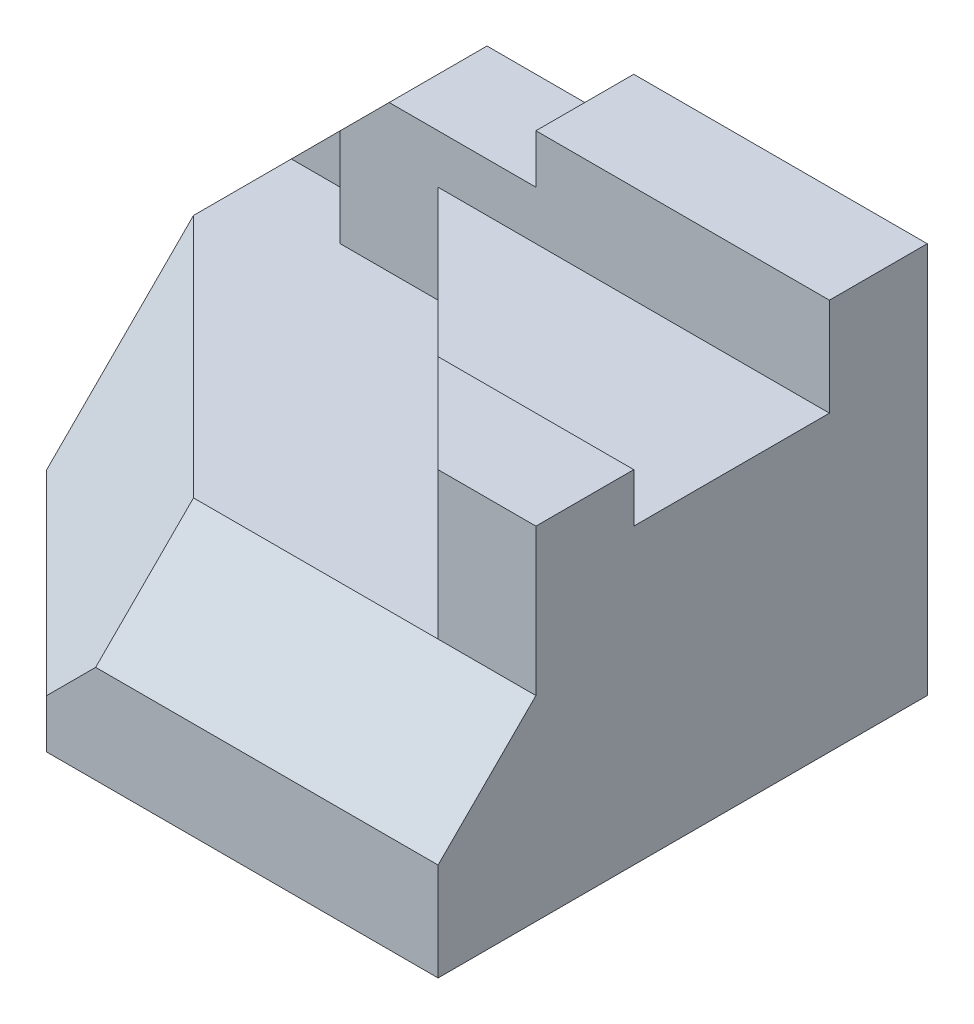
ISO-10303-21;
HEADER;
FILE_DESCRIPTION(('STEP AP214'),'2;1');
FILE_NAME('part.step','',(''),(''),'','','');
FILE_SCHEMA(('AUTOMOTIVE_DESIGN { 1 0 10303 214 1 1 1 1 }'));
ENDSEC;
DATA;
#1=APPLICATION_CONTEXT('core data for automotive mechanical design processes');
#2=APPLICATION_PROTOCOL_DEFINITION('international standard','automotive_design',2000,#1);
#3=PRODUCT_CONTEXT('',#1,'mechanical');
#4=PRODUCT('Part','Part','',(#3));
#5=PRODUCT_RELATED_PRODUCT_CATEGORY('part','',(#4));
#6=PRODUCT_DEFINITION_FORMATION('','',#4);
#7=PRODUCT_DEFINITION_CONTEXT('part definition',#1,'design');
#8=PRODUCT_DEFINITION('design','',#6,#7);
#9=PRODUCT_DEFINITION_SHAPE('','',#8);
#10=(LENGTH_UNIT() NAMED_UNIT(*) SI_UNIT(.MILLI.,.METRE.));
#11=(NAMED_UNIT(*) PLANE_ANGLE_UNIT() SI_UNIT($,.RADIAN.));
#12=(NAMED_UNIT(*) SI_UNIT($,.STERADIAN.) SOLID_ANGLE_UNIT());
#13=UNCERTAINTY_MEASURE_WITH_UNIT(LENGTH_MEASURE(1.E-05),#10,'distance_accuracy_value','');
#14=(GEOMETRIC_REPRESENTATION_CONTEXT(3) GLOBAL_UNCERTAINTY_ASSIGNED_CONTEXT((#13)) GLOBAL_UNIT_ASSIGNED_CONTEXT((#10,
#11,#12)) REPRESENTATION_CONTEXT('',''));
#15=CARTESIAN_POINT('',(0.,0.,0.));
#16=DIRECTION('',(0.,0.,1.));
#17=DIRECTION('',(1.,0.,0.));
#18=AXIS2_PLACEMENT_3D('',#15,#16,#17);
#19=CARTESIAN_POINT('',(-36.,60.,60.));
#20=DIRECTION('',(0.,-0.707106781186548,-0.707106781186548));
#21=DIRECTION('',(0.,0.707106781186548,-0.707106781186548));
#22=AXIS2_PLACEMENT_3D('',#19,#20,#21);
#23=PLANE('',#22);
#24=DIRECTION('',(1.,0.,0.));
#25=VECTOR('',#24,1.);
#26=CARTESIAN_POINT('',(-36.,40.,80.));
#27=LINE('',#26,#25);
#28=CARTESIAN_POINT('',(50.,40.,80.));
#29=VERTEX_POINT('',#28);
#30=CARTESIAN_POINT('',(100.,40.,80.));
#31=VERTEX_POINT('',#30);
#32=EDGE_CURVE('E91',#29,#31,#27,.T.);
#33=ORIENTED_EDGE('',*,*,#32,.F.);
#34=DIRECTION('',(0.,-0.707106781186547,0.707106781186547));
#35=VECTOR('',#34,1.);
#36=CARTESIAN_POINT('',(50.,60.,60.0000000000001));
#37=LINE('',#36,#35);
#38=CARTESIAN_POINT('',(50.,20.,100.));
#39=VERTEX_POINT('',#38);
#40=EDGE_CURVE('E51',#29,#39,#37,.T.);
#41=ORIENTED_EDGE('',*,*,#40,.T.);
#42=DIRECTION('',(1.,0.,0.));
#43=VECTOR('',#42,1.);
#44=CARTESIAN_POINT('',(-36.,20.,100.));
#45=LINE('',#44,#43);
#46=CARTESIAN_POINT('',(120.,20.,100.));
#47=VERTEX_POINT('',#46);
#48=EDGE_CURVE('E36',#39,#47,#45,.T.);
#49=ORIENTED_EDGE('',*,*,#48,.T.);
#50=DIRECTION('',(0.,0.707106781186548,-0.707106781186548));
#51=VECTOR('',#50,1.);
#52=CARTESIAN_POINT('',(120.,60.,60.));
#53=LINE('',#52,#51);
#54=CARTESIAN_POINT('',(120.,40.,80.));
#55=VERTEX_POINT('',#54);
#56=EDGE_CURVE('E186',#47,#55,#53,.T.);
#57=ORIENTED_EDGE('',*,*,#56,.T.);
#58=DIRECTION('',(1.,0.,0.));
#59=VECTOR('',#58,1.);
#60=CARTESIAN_POINT('',(120.,40.,80.));
#61=LINE('',#60,#59);
#62=EDGE_CURVE('E285',#31,#55,#61,.T.);
#63=ORIENTED_EDGE('',*,*,#62,.F.);
#64=EDGE_LOOP('',(#33,#41,#49,#57,#63));
#65=FACE_BOUND('',#64,.T.);
#66=ADVANCED_FACE('F33',(#65),#23,.F.);
#67=CARTESIAN_POINT('',(0.,60.,0.));
#68=DIRECTION('',(0.,-1.,0.));
#69=DIRECTION('',(0.,0.,-1.));
#70=AXIS2_PLACEMENT_3D('',#67,#68,#69);
#71=PLANE('',#70);
#72=DIRECTION('',(-1.,0.,0.));
#73=VECTOR('',#72,1.);
#74=CARTESIAN_POINT('',(80.,60.,60.));
#75=LINE('',#74,#73);
#76=CARTESIAN_POINT('',(120.,60.,60.));
#77=VERTEX_POINT('',#76);
#78=CARTESIAN_POINT('',(80.,60.,60.));
#79=VERTEX_POINT('',#78);
#80=EDGE_CURVE('E168',#77,#79,#75,.T.);
#81=ORIENTED_EDGE('',*,*,#80,.F.);
#82=DIRECTION('',(0.,0.,-1.));
#83=VECTOR('',#82,1.);
#84=CARTESIAN_POINT('',(120.,60.,20.));
#85=LINE('',#84,#83);
#86=CARTESIAN_POINT('',(120.,60.,20.));
#87=VERTEX_POINT('',#86);
#88=EDGE_CURVE('E171',#77,#87,#85,.T.);
#89=ORIENTED_EDGE('',*,*,#88,.T.);
#90=DIRECTION('',(-1.,0.,0.));
#91=VECTOR('',#90,1.);
#92=CARTESIAN_POINT('',(40.,60.,20.));
#93=LINE('',#92,#91);
#94=CARTESIAN_POINT('',(40.,60.,20.));
#95=VERTEX_POINT('',#94);
#96=EDGE_CURVE('E107',#87,#95,#93,.T.);
#97=ORIENTED_EDGE('',*,*,#96,.T.);
#98=DIRECTION('',(0.707106781186547,0.,0.707106781186547));
#99=VECTOR('',#98,1.);
#100=CARTESIAN_POINT('',(100.,60.,80.));
#101=LINE('',#100,#99);
#102=EDGE_CURVE('E102',#95,#79,#101,.T.);
#103=ORIENTED_EDGE('',*,*,#102,.T.);
#104=EDGE_LOOP('',(#81,#89,#97,#103));
#105=FACE_BOUND('',#104,.T.);
#106=ADVANCED_FACE('F170',(#105),#71,.F.);
#107=CARTESIAN_POINT('',(0.,40.,0.));
#108=DIRECTION('',(0.,1.,0.));
#109=DIRECTION('',(0.,0.,1.));
#110=AXIS2_PLACEMENT_3D('',#107,#108,#109);
#111=PLANE('',#110);
#112=DIRECTION('',(-0.707106781186548,0.,-0.707106781186547));
#113=VECTOR('',#112,1.);
#114=CARTESIAN_POINT('',(50.,40.,80.));
#115=LINE('',#114,#113);
#116=CARTESIAN_POINT('',(0.,40.,30.));
#117=VERTEX_POINT('',#116);
#118=EDGE_CURVE('E62',#29,#117,#115,.T.);
#119=ORIENTED_EDGE('',*,*,#118,.F.);
#120=ORIENTED_EDGE('',*,*,#32,.T.);
#121=DIRECTION('',(0.707106781186547,0.,0.707106781186547));
#122=VECTOR('',#121,1.);
#123=CARTESIAN_POINT('',(100.,40.,80.));
#124=LINE('',#123,#122);
#125=CARTESIAN_POINT('',(40.,40.,20.));
#126=VERTEX_POINT('',#125);
#127=EDGE_CURVE('E197',#126,#31,#124,.T.);
#128=ORIENTED_EDGE('',*,*,#127,.F.);
#129=DIRECTION('',(-1.,0.,0.));
#130=VECTOR('',#129,1.);
#131=CARTESIAN_POINT('',(0.,40.,20.));
#132=LINE('',#131,#130);
#133=CARTESIAN_POINT('',(20.,40.,20.));
#134=VERTEX_POINT('',#133);
#135=EDGE_CURVE('E205',#126,#134,#132,.T.);
#136=ORIENTED_EDGE('',*,*,#135,.T.);
#137=DIRECTION('',(0.,0.,1.));
#138=VECTOR('',#137,1.);
#139=CARTESIAN_POINT('',(20.,40.,10.));
#140=LINE('',#139,#138);
#141=CARTESIAN_POINT('',(20.,40.,10.));
#142=VERTEX_POINT('',#141);
#143=EDGE_CURVE('E266',#142,#134,#140,.T.);
#144=ORIENTED_EDGE('',*,*,#143,.F.);
#145=DIRECTION('',(1.,0.,0.));
#146=VECTOR('',#145,1.);
#147=CARTESIAN_POINT('',(0.,40.,10.));
#148=LINE('',#147,#146);
#149=CARTESIAN_POINT('',(0.,40.,10.));
#150=VERTEX_POINT('',#149);
#151=EDGE_CURVE('E269',#150,#142,#148,.T.);
#152=ORIENTED_EDGE('',*,*,#151,.F.);
#153=DIRECTION('',(0.,0.,-1.));
#154=VECTOR('',#153,1.);
#155=CARTESIAN_POINT('',(0.,40.,100.));
#156=LINE('',#155,#154);
#157=EDGE_CURVE('E235',#117,#150,#156,.T.);
#158=ORIENTED_EDGE('',*,*,#157,.F.);
#159=EDGE_LOOP('',(#119,#120,#128,#136,#144,#152,#158));
#160=FACE_BOUND('',#159,.T.);
#161=ADVANCED_FACE('F299',(#160),#111,.T.);
#162=CARTESIAN_POINT('',(0.,140.,20.));
#163=DIRECTION('',(0.,0.,1.));
#164=DIRECTION('',(1.,0.,0.));
#165=AXIS2_PLACEMENT_3D('',#162,#163,#164);
#166=PLANE('',#165);
#167=ORIENTED_EDGE('',*,*,#135,.F.);
#168=DIRECTION('',(0.,-1.,0.));
#169=VECTOR('',#168,1.);
#170=CARTESIAN_POINT('',(40.,60.,20.));
#171=LINE('',#170,#169);
#172=EDGE_CURVE('E196',#95,#126,#171,.T.);
#173=ORIENTED_EDGE('',*,*,#172,.F.);
#174=ORIENTED_EDGE('',*,*,#96,.F.);
#175=DIRECTION('',(0.,-1.,0.));
#176=VECTOR('',#175,1.);
#177=CARTESIAN_POINT('',(120.,140.,20.));
#178=LINE('',#177,#176);
#179=CARTESIAN_POINT('',(120.,80.,20.));
#180=VERTEX_POINT('',#179);
#181=EDGE_CURVE('E185',#180,#87,#178,.T.);
#182=ORIENTED_EDGE('',*,*,#181,.F.);
#183=DIRECTION('',(-1.,0.,0.));
#184=VECTOR('',#183,1.);
#185=CARTESIAN_POINT('',(0.,80.,20.));
#186=LINE('',#185,#184);
#187=CARTESIAN_POINT('',(60.,80.,20.));
#188=VERTEX_POINT('',#187);
#189=EDGE_CURVE('E253',#180,#188,#186,.T.);
#190=ORIENTED_EDGE('',*,*,#189,.T.);
#191=DIRECTION('',(0.,-1.,0.));
#192=VECTOR('',#191,1.);
#193=CARTESIAN_POINT('',(60.,70.,20.));
#194=LINE('',#193,#192);
#195=CARTESIAN_POINT('',(60.,70.,20.));
#196=VERTEX_POINT('',#195);
#197=EDGE_CURVE('E255',#188,#196,#194,.T.);
#198=ORIENTED_EDGE('',*,*,#197,.T.);
#199=DIRECTION('',(-1.,0.,0.));
#200=VECTOR('',#199,1.);
#201=CARTESIAN_POINT('',(30.,70.,20.));
#202=LINE('',#201,#200);
#203=CARTESIAN_POINT('',(30.,70.,20.));
#204=VERTEX_POINT('',#203);
#205=EDGE_CURVE('E260',#196,#204,#202,.T.);
#206=ORIENTED_EDGE('',*,*,#205,.T.);
#207=DIRECTION('',(-0.707106781186547,-0.707106781186548,0.));
#208=VECTOR('',#207,1.);
#209=CARTESIAN_POINT('',(0.,40.,20.));
#210=LINE('',#209,#208);
#211=CARTESIAN_POINT('',(20.,60.,20.));
#212=VERTEX_POINT('',#211);
#213=EDGE_CURVE('E256',#204,#212,#210,.T.);
#214=ORIENTED_EDGE('',*,*,#213,.T.);
#215=DIRECTION('',(0.,1.,0.));
#216=VECTOR('',#215,1.);
#217=CARTESIAN_POINT('',(20.,40.,20.));
#218=LINE('',#217,#216);
#219=EDGE_CURVE('E270',#134,#212,#218,.T.);
#220=ORIENTED_EDGE('',*,*,#219,.F.);
#221=EDGE_LOOP('',(#167,#173,#174,#182,#190,#198,#206,#214,#220));
#222=FACE_BOUND('',#221,.T.);
#223=ADVANCED_FACE('F302',(#222),#166,.T.);
#224=CARTESIAN_POINT('',(120.,0.,100.));
#225=DIRECTION('',(-1.,0.,0.));
#226=DIRECTION('',(0.,0.,1.));
#227=AXIS2_PLACEMENT_3D('',#224,#225,#226);
#228=PLANE('',#227);
#229=DIRECTION('',(0.,-1.,0.));
#230=VECTOR('',#229,1.);
#231=CARTESIAN_POINT('',(120.,60.,80.));
#232=LINE('',#231,#230);
#233=CARTESIAN_POINT('',(120.,70.,80.));
#234=VERTEX_POINT('',#233);
#235=EDGE_CURVE('E259',#234,#55,#232,.T.);
#236=ORIENTED_EDGE('',*,*,#235,.T.);
#237=ORIENTED_EDGE('',*,*,#56,.F.);
#238=DIRECTION('',(0.,1.,0.));
#239=VECTOR('',#238,1.);
#240=CARTESIAN_POINT('',(120.,0.,100.));
#241=LINE('',#240,#239);
#242=CARTESIAN_POINT('',(120.,0.,100.));
#243=VERTEX_POINT('',#242);
#244=EDGE_CURVE('E218',#243,#47,#241,.T.);
#245=ORIENTED_EDGE('',*,*,#244,.F.);
#246=DIRECTION('',(0.,0.,-1.));
#247=VECTOR('',#246,1.);
#248=CARTESIAN_POINT('',(120.,0.,100.));
#249=LINE('',#248,#247);
#250=CARTESIAN_POINT('',(120.,0.,0.));
#251=VERTEX_POINT('',#250);
#252=EDGE_CURVE('E287',#243,#251,#249,.T.);
#253=ORIENTED_EDGE('',*,*,#252,.T.);
#254=DIRECTION('',(0.,1.,0.));
#255=VECTOR('',#254,1.);
#256=CARTESIAN_POINT('',(120.,0.,0.));
#257=LINE('',#256,#255);
#258=CARTESIAN_POINT('',(120.,80.,0.));
#259=VERTEX_POINT('',#258);
#260=EDGE_CURVE('E264',#251,#259,#257,.T.);
#261=ORIENTED_EDGE('',*,*,#260,.T.);
#262=DIRECTION('',(0.,0.,-1.));
#263=VECTOR('',#262,1.);
#264=CARTESIAN_POINT('',(120.,80.,100.));
#265=LINE('',#264,#263);
#266=EDGE_CURVE('E263',#180,#259,#265,.T.);
#267=ORIENTED_EDGE('',*,*,#266,.F.);
#268=ORIENTED_EDGE('',*,*,#181,.T.);
#269=ORIENTED_EDGE('',*,*,#88,.F.);
#270=DIRECTION('',(0.,-1.,0.));
#271=VECTOR('',#270,1.);
#272=CARTESIAN_POINT('',(120.,70.,60.));
#273=LINE('',#272,#271);
#274=CARTESIAN_POINT('',(120.,70.,60.));
#275=VERTEX_POINT('',#274);
#276=EDGE_CURVE('E175',#275,#77,#273,.T.);
#277=ORIENTED_EDGE('',*,*,#276,.F.);
#278=DIRECTION('',(0.,0.,-1.));
#279=VECTOR('',#278,1.);
#280=CARTESIAN_POINT('',(120.,70.,60.));
#281=LINE('',#280,#279);
#282=EDGE_CURVE('E200',#234,#275,#281,.T.);
#283=ORIENTED_EDGE('',*,*,#282,.F.);
#284=EDGE_LOOP('',(#236,#237,#245,#253,#261,#267,#268,#269,#277,#283));
#285=FACE_BOUND('',#284,.T.);
#286=ADVANCED_FACE('F182',(#285),#228,.F.);
#287=CARTESIAN_POINT('',(0.,80.,100.));
#288=DIRECTION('',(0.,-1.,0.));
#289=DIRECTION('',(0.,0.,-1.));
#290=AXIS2_PLACEMENT_3D('',#287,#288,#289);
#291=PLANE('',#290);
#292=ORIENTED_EDGE('',*,*,#189,.F.);
#293=ORIENTED_EDGE('',*,*,#266,.T.);
#294=DIRECTION('',(-1.,0.,0.));
#295=VECTOR('',#294,1.);
#296=CARTESIAN_POINT('',(0.,80.,0.));
#297=LINE('',#296,#295);
#298=CARTESIAN_POINT('',(60.,80.,0.));
#299=VERTEX_POINT('',#298);
#300=EDGE_CURVE('E213',#259,#299,#297,.T.);
#301=ORIENTED_EDGE('',*,*,#300,.T.);
#302=DIRECTION('',(0.,0.,-1.));
#303=VECTOR('',#302,1.);
#304=CARTESIAN_POINT('',(60.,80.,100.));
#305=LINE('',#304,#303);
#306=EDGE_CURVE('E237',#188,#299,#305,.T.);
#307=ORIENTED_EDGE('',*,*,#306,.F.);
#308=EDGE_LOOP('',(#292,#293,#301,#307));
#309=FACE_BOUND('',#308,.T.);
#310=ADVANCED_FACE('F374',(#309),#291,.F.);
#311=CARTESIAN_POINT('',(0.,0.,100.));
#312=DIRECTION('',(0.,0.,-1.));
#313=DIRECTION('',(-1.,0.,0.));
#314=AXIS2_PLACEMENT_3D('',#311,#312,#313);
#315=PLANE('',#314);
#316=ORIENTED_EDGE('',*,*,#48,.F.);
#317=DIRECTION('',(-0.707106781186548,-0.707106781186547,0.));
#318=VECTOR('',#317,1.);
#319=CARTESIAN_POINT('',(14.9999999999999,-15.,100.));
#320=LINE('',#319,#318);
#321=CARTESIAN_POINT('',(40.,9.99999999999998,100.));
#322=VERTEX_POINT('',#321);
#323=EDGE_CURVE('E210',#39,#322,#320,.T.);
#324=ORIENTED_EDGE('',*,*,#323,.T.);
#325=DIRECTION('',(0.,-1.,0.));
#326=VECTOR('',#325,1.);
#327=CARTESIAN_POINT('',(40.,0.,100.));
#328=LINE('',#327,#326);
#329=CARTESIAN_POINT('',(40.,0.,100.));
#330=VERTEX_POINT('',#329);
#331=EDGE_CURVE('E212',#322,#330,#328,.T.);
#332=ORIENTED_EDGE('',*,*,#331,.T.);
#333=DIRECTION('',(1.,0.,0.));
#334=VECTOR('',#333,1.);
#335=CARTESIAN_POINT('',(0.,0.,100.));
#336=LINE('',#335,#334);
#337=EDGE_CURVE('E214',#330,#243,#336,.T.);
#338=ORIENTED_EDGE('',*,*,#337,.T.);
#339=ORIENTED_EDGE('',*,*,#244,.T.);
#340=EDGE_LOOP('',(#316,#324,#332,#338,#339));
#341=FACE_BOUND('',#340,.T.);
#342=ADVANCED_FACE('F324',(#341),#315,.F.);
#343=CARTESIAN_POINT('',(0.,-20.,60.));
#344=DIRECTION('',(0.707106781186548,0.,-0.707106781186548));
#345=DIRECTION('',(-0.707106781186548,0.,-0.707106781186548));
#346=AXIS2_PLACEMENT_3D('',#343,#344,#345);
#347=PLANE('',#346);
#348=ORIENTED_EDGE('',*,*,#331,.F.);
#349=DIRECTION('',(0.707106781186548,0.,0.707106781186547));
#350=VECTOR('',#349,1.);
#351=CARTESIAN_POINT('',(0.,10.,60.));
#352=LINE('',#351,#350);
#353=CARTESIAN_POINT('',(0.,10.,60.));
#354=VERTEX_POINT('',#353);
#355=EDGE_CURVE('E11',#354,#322,#352,.T.);
#356=ORIENTED_EDGE('',*,*,#355,.F.);
#357=DIRECTION('',(0.,1.,0.));
#358=VECTOR('',#357,1.);
#359=CARTESIAN_POINT('',(0.,-20.,60.));
#360=LINE('',#359,#358);
#361=CARTESIAN_POINT('',(0.,0.,60.));
#362=VERTEX_POINT('',#361);
#363=EDGE_CURVE('E232',#362,#354,#360,.T.);
#364=ORIENTED_EDGE('',*,*,#363,.F.);
#365=DIRECTION('',(-0.707106781186548,0.,-0.707106781186548));
#366=VECTOR('',#365,1.);
#367=CARTESIAN_POINT('',(20.,0.,80.));
#368=LINE('',#367,#366);
#369=EDGE_CURVE('E227',#330,#362,#368,.T.);
#370=ORIENTED_EDGE('',*,*,#369,.F.);
#371=EDGE_LOOP('',(#348,#356,#364,#370));
#372=FACE_BOUND('',#371,.T.);
#373=ADVANCED_FACE('F322',(#372),#347,.F.);
#374=CARTESIAN_POINT('',(0.,40.,100.));
#375=DIRECTION('',(0.707106781186548,-0.707106781186547,0.));
#376=DIRECTION('',(0.707106781186547,0.707106781186548,0.));
#377=AXIS2_PLACEMENT_3D('',#374,#375,#376);
#378=PLANE('',#377);
#379=DIRECTION('',(-0.707106781186547,-0.707106781186548,0.));
#380=VECTOR('',#379,1.);
#381=CARTESIAN_POINT('',(20.,60.,10.));
#382=LINE('',#381,#380);
#383=CARTESIAN_POINT('',(20.,60.,10.));
#384=VERTEX_POINT('',#383);
#385=EDGE_CURVE('E275',#384,#150,#382,.T.);
#386=ORIENTED_EDGE('',*,*,#385,.F.);
#387=DIRECTION('',(0.,0.,1.));
#388=VECTOR('',#387,1.);
#389=CARTESIAN_POINT('',(20.,60.,10.));
#390=LINE('',#389,#388);
#391=EDGE_CURVE('E223',#384,#212,#390,.T.);
#392=ORIENTED_EDGE('',*,*,#391,.T.);
#393=ORIENTED_EDGE('',*,*,#213,.F.);
#394=DIRECTION('',(0.,0.,-1.));
#395=VECTOR('',#394,1.);
#396=CARTESIAN_POINT('',(30.,70.,100.));
#397=LINE('',#396,#395);
#398=CARTESIAN_POINT('',(30.,70.,0.));
#399=VERTEX_POINT('',#398);
#400=EDGE_CURVE('E243',#204,#399,#397,.T.);
#401=ORIENTED_EDGE('',*,*,#400,.T.);
#402=DIRECTION('',(-0.707106781186547,-0.707106781186548,0.));
#403=VECTOR('',#402,1.);
#404=CARTESIAN_POINT('',(0.,40.,0.));
#405=LINE('',#404,#403);
#406=CARTESIAN_POINT('',(0.,40.,0.));
#407=VERTEX_POINT('',#406);
#408=EDGE_CURVE('E242',#399,#407,#405,.T.);
#409=ORIENTED_EDGE('',*,*,#408,.T.);
#410=EDGE_CURVE('E246',#150,#407,#156,.T.);
#411=ORIENTED_EDGE('',*,*,#410,.F.);
#412=EDGE_LOOP('',(#386,#392,#393,#401,#409,#411));
#413=FACE_BOUND('',#412,.T.);
#414=ADVANCED_FACE('F309',(#413),#378,.F.);
#415=CARTESIAN_POINT('',(30.,70.,100.));
#416=DIRECTION('',(0.,-1.,0.));
#417=DIRECTION('',(0.,0.,-1.));
#418=AXIS2_PLACEMENT_3D('',#415,#416,#417);
#419=PLANE('',#418);
#420=ORIENTED_EDGE('',*,*,#205,.F.);
#421=DIRECTION('',(0.,0.,-1.));
#422=VECTOR('',#421,1.);
#423=CARTESIAN_POINT('',(60.,70.,100.));
#424=LINE('',#423,#422);
#425=CARTESIAN_POINT('',(60.,70.,0.));
#426=VERTEX_POINT('',#425);
#427=EDGE_CURVE('E240',#196,#426,#424,.T.);
#428=ORIENTED_EDGE('',*,*,#427,.T.);
#429=DIRECTION('',(-1.,0.,0.));
#430=VECTOR('',#429,1.);
#431=CARTESIAN_POINT('',(30.,70.,0.));
#432=LINE('',#431,#430);
#433=EDGE_CURVE('E239',#426,#399,#432,.T.);
#434=ORIENTED_EDGE('',*,*,#433,.T.);
#435=ORIENTED_EDGE('',*,*,#400,.F.);
#436=EDGE_LOOP('',(#420,#428,#434,#435));
#437=FACE_BOUND('',#436,.T.);
#438=ADVANCED_FACE('F362',(#437),#419,.F.);
#439=CARTESIAN_POINT('',(60.,70.,100.));
#440=DIRECTION('',(1.,0.,0.));
#441=DIRECTION('',(0.,0.,-1.));
#442=AXIS2_PLACEMENT_3D('',#439,#440,#441);
#443=PLANE('',#442);
#444=ORIENTED_EDGE('',*,*,#197,.F.);
#445=ORIENTED_EDGE('',*,*,#306,.T.);
#446=DIRECTION('',(0.,-1.,0.));
#447=VECTOR('',#446,1.);
#448=CARTESIAN_POINT('',(60.,70.,0.));
#449=LINE('',#448,#447);
#450=EDGE_CURVE('E236',#299,#426,#449,.T.);
#451=ORIENTED_EDGE('',*,*,#450,.T.);
#452=ORIENTED_EDGE('',*,*,#427,.F.);
#453=EDGE_LOOP('',(#444,#445,#451,#452));
#454=FACE_BOUND('',#453,.T.);
#455=ADVANCED_FACE('F365',(#454),#443,.F.);
#456=CARTESIAN_POINT('',(0.,0.,100.));
#457=DIRECTION('',(1.,0.,0.));
#458=DIRECTION('',(0.,0.,-1.));
#459=AXIS2_PLACEMENT_3D('',#456,#457,#458);
#460=PLANE('',#459);
#461=ORIENTED_EDGE('',*,*,#363,.T.);
#462=DIRECTION('',(0.,-0.707106781186547,0.707106781186548));
#463=VECTOR('',#462,1.);
#464=CARTESIAN_POINT('',(0.,40.,30.));
#465=LINE('',#464,#463);
#466=EDGE_CURVE('E42',#117,#354,#465,.T.);
#467=ORIENTED_EDGE('',*,*,#466,.F.);
#468=ORIENTED_EDGE('',*,*,#157,.T.);
#469=ORIENTED_EDGE('',*,*,#410,.T.);
#470=DIRECTION('',(0.,-1.,0.));
#471=VECTOR('',#470,1.);
#472=CARTESIAN_POINT('',(0.,0.,0.));
#473=LINE('',#472,#471);
#474=CARTESIAN_POINT('',(0.,0.,0.));
#475=VERTEX_POINT('',#474);
#476=EDGE_CURVE('E231',#407,#475,#473,.T.);
#477=ORIENTED_EDGE('',*,*,#476,.T.);
#478=DIRECTION('',(0.,0.,-1.));
#479=VECTOR('',#478,1.);
#480=CARTESIAN_POINT('',(0.,0.,100.));
#481=LINE('',#480,#479);
#482=EDGE_CURVE('E230',#362,#475,#481,.T.);
#483=ORIENTED_EDGE('',*,*,#482,.F.);
#484=EDGE_LOOP('',(#461,#467,#468,#469,#477,#483));
#485=FACE_BOUND('',#484,.T.);
#486=ADVANCED_FACE('F317',(#485),#460,.F.);
#487=CARTESIAN_POINT('',(0.,0.,100.));
#488=DIRECTION('',(0.,1.,0.));
#489=DIRECTION('',(0.,0.,1.));
#490=AXIS2_PLACEMENT_3D('',#487,#488,#489);
#491=PLANE('',#490);
#492=ORIENTED_EDGE('',*,*,#337,.F.);
#493=ORIENTED_EDGE('',*,*,#369,.T.);
#494=ORIENTED_EDGE('',*,*,#482,.T.);
#495=DIRECTION('',(1.,0.,0.));
#496=VECTOR('',#495,1.);
#497=CARTESIAN_POINT('',(0.,0.,0.));
#498=LINE('',#497,#496);
#499=EDGE_CURVE('E274',#475,#251,#498,.T.);
#500=ORIENTED_EDGE('',*,*,#499,.T.);
#501=ORIENTED_EDGE('',*,*,#252,.F.);
#502=EDGE_LOOP('',(#492,#493,#494,#500,#501));
#503=FACE_BOUND('',#502,.T.);
#504=ADVANCED_FACE('F372',(#503),#491,.F.);
#505=CARTESIAN_POINT('',(0.,0.,0.));
#506=DIRECTION('',(0.,0.,-1.));
#507=DIRECTION('',(-1.,0.,0.));
#508=AXIS2_PLACEMENT_3D('',#505,#506,#507);
#509=PLANE('',#508);
#510=ORIENTED_EDGE('',*,*,#408,.F.);
#511=ORIENTED_EDGE('',*,*,#433,.F.);
#512=ORIENTED_EDGE('',*,*,#450,.F.);
#513=ORIENTED_EDGE('',*,*,#300,.F.);
#514=ORIENTED_EDGE('',*,*,#260,.F.);
#515=ORIENTED_EDGE('',*,*,#499,.F.);
#516=ORIENTED_EDGE('',*,*,#476,.F.);
#517=EDGE_LOOP('',(#510,#511,#512,#513,#514,#515,#516));
#518=FACE_BOUND('',#517,.T.);
#519=ADVANCED_FACE('F356',(#518),#509,.T.);
#520=CARTESIAN_POINT('',(20.,40.,10.));
#521=DIRECTION('',(1.,0.,0.));
#522=DIRECTION('',(0.,0.,-1.));
#523=AXIS2_PLACEMENT_3D('',#520,#521,#522);
#524=PLANE('',#523);
#525=ORIENTED_EDGE('',*,*,#219,.T.);
#526=ORIENTED_EDGE('',*,*,#391,.F.);
#527=DIRECTION('',(0.,1.,0.));
#528=VECTOR('',#527,1.);
#529=CARTESIAN_POINT('',(20.,40.,10.));
#530=LINE('',#529,#528);
#531=EDGE_CURVE('E278',#142,#384,#530,.T.);
#532=ORIENTED_EDGE('',*,*,#531,.F.);
#533=ORIENTED_EDGE('',*,*,#143,.T.);
#534=EDGE_LOOP('',(#525,#526,#532,#533));
#535=FACE_BOUND('',#534,.T.);
#536=ADVANCED_FACE('F305',(#535),#524,.F.);
#537=CARTESIAN_POINT('',(0.,0.,10.));
#538=DIRECTION('',(0.,0.,1.));
#539=DIRECTION('',(1.,0.,0.));
#540=AXIS2_PLACEMENT_3D('',#537,#538,#539);
#541=PLANE('',#540);
#542=ORIENTED_EDGE('',*,*,#151,.T.);
#543=ORIENTED_EDGE('',*,*,#531,.T.);
#544=ORIENTED_EDGE('',*,*,#385,.T.);
#545=EDGE_LOOP('',(#542,#543,#544));
#546=FACE_BOUND('',#545,.T.);
#547=ADVANCED_FACE('F313',(#546),#541,.T.);
#548=CARTESIAN_POINT('',(100.,60.,80.));
#549=DIRECTION('',(0.707106781186548,0.,-0.707106781186548));
#550=DIRECTION('',(-0.707106781186548,0.,-0.707106781186548));
#551=AXIS2_PLACEMENT_3D('',#548,#549,#550);
#552=PLANE('',#551);
#553=ORIENTED_EDGE('',*,*,#127,.T.);
#554=DIRECTION('',(0.,-1.,0.));
#555=VECTOR('',#554,1.);
#556=CARTESIAN_POINT('',(100.,60.,80.));
#557=LINE('',#556,#555);
#558=CARTESIAN_POINT('',(100.,70.,80.));
#559=VERTEX_POINT('',#558);
#560=EDGE_CURVE('E176',#559,#31,#557,.T.);
#561=ORIENTED_EDGE('',*,*,#560,.F.);
#562=DIRECTION('',(0.707106781186548,0.,0.707106781186548));
#563=VECTOR('',#562,1.);
#564=CARTESIAN_POINT('',(100.,70.,80.));
#565=LINE('',#564,#563);
#566=CARTESIAN_POINT('',(80.,70.,60.));
#567=VERTEX_POINT('',#566);
#568=EDGE_CURVE('E189',#567,#559,#565,.T.);
#569=ORIENTED_EDGE('',*,*,#568,.F.);
#570=DIRECTION('',(0.,-1.,0.));
#571=VECTOR('',#570,1.);
#572=CARTESIAN_POINT('',(80.,70.,60.));
#573=LINE('',#572,#571);
#574=EDGE_CURVE('E195',#567,#79,#573,.T.);
#575=ORIENTED_EDGE('',*,*,#574,.T.);
#576=ORIENTED_EDGE('',*,*,#102,.F.);
#577=ORIENTED_EDGE('',*,*,#172,.T.);
#578=EDGE_LOOP('',(#553,#561,#569,#575,#576,#577));
#579=FACE_BOUND('',#578,.T.);
#580=ADVANCED_FACE('F294',(#579),#552,.F.);
#581=CARTESIAN_POINT('',(120.,60.,80.));
#582=DIRECTION('',(0.,0.,-1.));
#583=DIRECTION('',(-1.,0.,0.));
#584=AXIS2_PLACEMENT_3D('',#581,#582,#583);
#585=PLANE('',#584);
#586=ORIENTED_EDGE('',*,*,#62,.T.);
#587=ORIENTED_EDGE('',*,*,#235,.F.);
#588=DIRECTION('',(1.,0.,0.));
#589=VECTOR('',#588,1.);
#590=CARTESIAN_POINT('',(120.,70.,80.));
#591=LINE('',#590,#589);
#592=EDGE_CURVE('E191',#559,#234,#591,.T.);
#593=ORIENTED_EDGE('',*,*,#592,.F.);
#594=ORIENTED_EDGE('',*,*,#560,.T.);
#595=EDGE_LOOP('',(#586,#587,#593,#594));
#596=FACE_BOUND('',#595,.T.);
#597=ADVANCED_FACE('F329',(#596),#585,.F.);
#598=CARTESIAN_POINT('',(80.,70.,60.));
#599=DIRECTION('',(0.,0.,1.));
#600=DIRECTION('',(1.,0.,0.));
#601=AXIS2_PLACEMENT_3D('',#598,#599,#600);
#602=PLANE('',#601);
#603=ORIENTED_EDGE('',*,*,#80,.T.);
#604=ORIENTED_EDGE('',*,*,#574,.F.);
#605=DIRECTION('',(-1.,0.,0.));
#606=VECTOR('',#605,1.);
#607=CARTESIAN_POINT('',(80.,70.,60.));
#608=LINE('',#607,#606);
#609=EDGE_CURVE('E71',#275,#567,#608,.T.);
#610=ORIENTED_EDGE('',*,*,#609,.F.);
#611=ORIENTED_EDGE('',*,*,#276,.T.);
#612=EDGE_LOOP('',(#603,#604,#610,#611));
#613=FACE_BOUND('',#612,.T.);
#614=ADVANCED_FACE('F188',(#613),#602,.F.);
#615=CARTESIAN_POINT('',(0.,70.,0.));
#616=DIRECTION('',(0.,-1.,0.));
#617=DIRECTION('',(0.,0.,-1.));
#618=AXIS2_PLACEMENT_3D('',#615,#616,#617);
#619=PLANE('',#618);
#620=ORIENTED_EDGE('',*,*,#568,.T.);
#621=ORIENTED_EDGE('',*,*,#592,.T.);
#622=ORIENTED_EDGE('',*,*,#282,.T.);
#623=ORIENTED_EDGE('',*,*,#609,.T.);
#624=EDGE_LOOP('',(#620,#621,#622,#623));
#625=FACE_BOUND('',#624,.T.);
#626=ADVANCED_FACE('F330',(#625),#619,.F.);
#627=CARTESIAN_POINT('',(-23.3333333333333,23.3333333333334,23.3333333333333));
#628=DIRECTION('',(0.577350269189625,-0.577350269189627,-0.577350269189626));
#629=DIRECTION('',(0.,0.707106781186547,-0.707106781186548));
#630=AXIS2_PLACEMENT_3D('',#627,#628,#629);
#631=PLANE('',#630);
#632=ORIENTED_EDGE('',*,*,#118,.T.);
#633=ORIENTED_EDGE('',*,*,#466,.T.);
#634=ORIENTED_EDGE('',*,*,#355,.T.);
#635=ORIENTED_EDGE('',*,*,#323,.F.);
#636=ORIENTED_EDGE('',*,*,#40,.F.);
#637=EDGE_LOOP('',(#632,#633,#634,#635,#636));
#638=FACE_BOUND('',#637,.T.);
#639=ADVANCED_FACE('F320',(#638),#631,.F.);
#640=CLOSED_SHELL('',(#66,#106,#161,#223,#286,#310,#342,#373,#414,#438,#455,#486,#504,#519,#536,
#547,#580,#597,#614,#626,#639));
#641=MANIFOLD_SOLID_BREP('B2',#640);
#642=ADVANCED_BREP_SHAPE_REPRESENTATION('',(#18,#641),#14);
#643=SHAPE_DEFINITION_REPRESENTATION(#9,#642);
ENDSEC;
END-ISO-10303-21;
